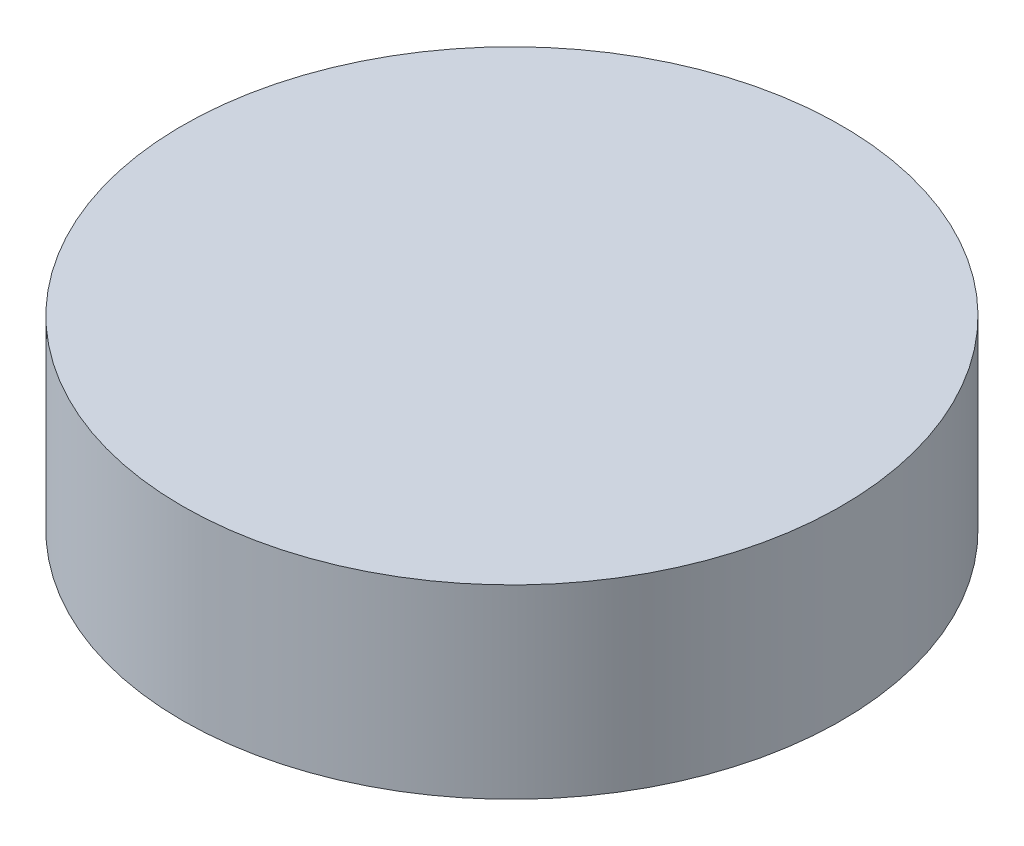
ISO-10303-21;
HEADER;
FILE_DESCRIPTION(('STEP AP214'),'2;1');
FILE_NAME('part.step','',(''),(''),'','','');
FILE_SCHEMA(('AUTOMOTIVE_DESIGN { 1 0 10303 214 1 1 1 1 }'));
ENDSEC;
DATA;
#1=APPLICATION_CONTEXT('core data for automotive mechanical design processes');
#2=APPLICATION_PROTOCOL_DEFINITION('international standard','automotive_design',2000,#1);
#3=PRODUCT_CONTEXT('',#1,'mechanical');
#4=PRODUCT('Part','Part','',(#3));
#5=PRODUCT_RELATED_PRODUCT_CATEGORY('part','',(#4));
#6=PRODUCT_DEFINITION_FORMATION('','',#4);
#7=PRODUCT_DEFINITION_CONTEXT('part definition',#1,'design');
#8=PRODUCT_DEFINITION('design','',#6,#7);
#9=PRODUCT_DEFINITION_SHAPE('','',#8);
#10=(LENGTH_UNIT() NAMED_UNIT(*) SI_UNIT(.MILLI.,.METRE.));
#11=(NAMED_UNIT(*) PLANE_ANGLE_UNIT() SI_UNIT($,.RADIAN.));
#12=(NAMED_UNIT(*) SI_UNIT($,.STERADIAN.) SOLID_ANGLE_UNIT());
#13=UNCERTAINTY_MEASURE_WITH_UNIT(LENGTH_MEASURE(1.E-05),#10,'distance_accuracy_value','');
#14=(GEOMETRIC_REPRESENTATION_CONTEXT(3) GLOBAL_UNCERTAINTY_ASSIGNED_CONTEXT((#13)) GLOBAL_UNIT_ASSIGNED_CONTEXT((#10,
#11,#12)) REPRESENTATION_CONTEXT('',''));
#15=CARTESIAN_POINT('',(0.,0.,0.));
#16=DIRECTION('',(0.,0.,1.));
#17=DIRECTION('',(1.,0.,0.));
#18=AXIS2_PLACEMENT_3D('',#15,#16,#17);
#19=CARTESIAN_POINT('',(0.,5.,0.));
#20=DIRECTION('',(0.,-1.,0.));
#21=DIRECTION('',(0.,0.,-1.));
#22=AXIS2_PLACEMENT_3D('',#19,#20,#21);
#23=CYLINDRICAL_SURFACE('',#22,8.875);
#24=CARTESIAN_POINT('',(0.,5.,0.));
#25=DIRECTION('',(0.,1.,0.));
#26=DIRECTION('',(0.,0.,1.));
#27=AXIS2_PLACEMENT_3D('',#24,#25,#26);
#28=CIRCLE('',#27,8.875);
#29=CARTESIAN_POINT('',(0.,5.,8.875));
#30=VERTEX_POINT('',#29);
#31=EDGE_CURVE('E10',#30,#30,#28,.T.);
#32=ORIENTED_EDGE('',*,*,#31,.F.);
#33=EDGE_LOOP('',(#32));
#34=FACE_BOUND('',#33,.T.);
#35=CARTESIAN_POINT('',(0.,0.,0.));
#36=DIRECTION('',(0.,1.,0.));
#37=DIRECTION('',(0.,0.,1.));
#38=AXIS2_PLACEMENT_3D('',#35,#36,#37);
#39=CIRCLE('',#38,8.875);
#40=CARTESIAN_POINT('',(0.,0.,8.875));
#41=VERTEX_POINT('',#40);
#42=EDGE_CURVE('E40',#41,#41,#39,.T.);
#43=ORIENTED_EDGE('',*,*,#42,.T.);
#44=EDGE_LOOP('',(#43));
#45=FACE_BOUND('',#44,.T.);
#46=ADVANCED_FACE('F37',(#34,#45),#23,.T.);
#47=CARTESIAN_POINT('',(0.,5.,0.));
#48=DIRECTION('',(0.,1.,0.));
#49=DIRECTION('',(0.,0.,1.));
#50=AXIS2_PLACEMENT_3D('',#47,#48,#49);
#51=PLANE('',#50);
#52=ORIENTED_EDGE('',*,*,#31,.T.);
#53=EDGE_LOOP('',(#52));
#54=FACE_BOUND('',#53,.T.);
#55=ADVANCED_FACE('F54',(#54),#51,.T.);
#56=CARTESIAN_POINT('',(0.,0.,0.));
#57=DIRECTION('',(0.,1.,0.));
#58=DIRECTION('',(0.,0.,1.));
#59=AXIS2_PLACEMENT_3D('',#56,#57,#58);
#60=PLANE('',#59);
#61=ORIENTED_EDGE('',*,*,#42,.F.);
#62=EDGE_LOOP('',(#61));
#63=FACE_BOUND('',#62,.T.);
#64=ADVANCED_FACE('F52',(#63),#60,.F.);
#65=CLOSED_SHELL('',(#46,#55,#64));
#66=MANIFOLD_SOLID_BREP('B2',#65);
#67=ADVANCED_BREP_SHAPE_REPRESENTATION('',(#18,#66),#14);
#68=SHAPE_DEFINITION_REPRESENTATION(#9,#67);
ENDSEC;
END-ISO-10303-21;
